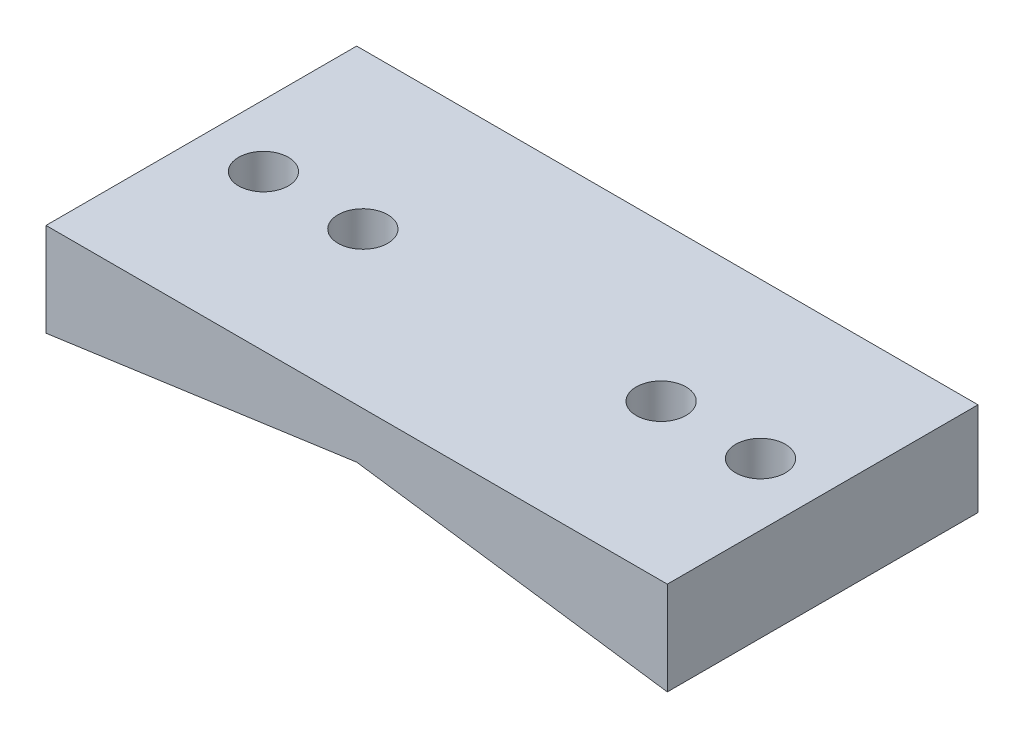
ISO-10303-21;
HEADER;
FILE_DESCRIPTION(('STEP AP214'),'2;1');
FILE_NAME('part.step','',(''),(''),'','','');
FILE_SCHEMA(('AUTOMOTIVE_DESIGN { 1 0 10303 214 1 1 1 1 }'));
ENDSEC;
DATA;
#1=APPLICATION_CONTEXT('core data for automotive mechanical design processes');
#2=APPLICATION_PROTOCOL_DEFINITION('international standard','automotive_design',2000,#1);
#3=PRODUCT_CONTEXT('',#1,'mechanical');
#4=PRODUCT('Part','Part','',(#3));
#5=PRODUCT_RELATED_PRODUCT_CATEGORY('part','',(#4));
#6=PRODUCT_DEFINITION_FORMATION('','',#4);
#7=PRODUCT_DEFINITION_CONTEXT('part definition',#1,'design');
#8=PRODUCT_DEFINITION('design','',#6,#7);
#9=PRODUCT_DEFINITION_SHAPE('','',#8);
#10=(LENGTH_UNIT() NAMED_UNIT(*) SI_UNIT(.MILLI.,.METRE.));
#11=(NAMED_UNIT(*) PLANE_ANGLE_UNIT() SI_UNIT($,.RADIAN.));
#12=(NAMED_UNIT(*) SI_UNIT($,.STERADIAN.) SOLID_ANGLE_UNIT());
#13=UNCERTAINTY_MEASURE_WITH_UNIT(LENGTH_MEASURE(1.E-05),#10,'distance_accuracy_value','');
#14=(GEOMETRIC_REPRESENTATION_CONTEXT(3) GLOBAL_UNCERTAINTY_ASSIGNED_CONTEXT((#13)) GLOBAL_UNIT_ASSIGNED_CONTEXT((#10,
#11,#12)) REPRESENTATION_CONTEXT('',''));
#15=CARTESIAN_POINT('',(0.,0.,0.));
#16=DIRECTION('',(0.,0.,1.));
#17=DIRECTION('',(1.,0.,0.));
#18=AXIS2_PLACEMENT_3D('',#15,#16,#17);
#19=CARTESIAN_POINT('',(-50.,-10.,25.));
#20=DIRECTION('',(-1.,0.,0.));
#21=DIRECTION('',(0.,0.,1.));
#22=AXIS2_PLACEMENT_3D('',#19,#20,#21);
#23=PLANE('',#22);
#24=DIRECTION('',(0.,0.,-1.));
#25=VECTOR('',#24,1.);
#26=CARTESIAN_POINT('',(-50.,-5.02704173511958,25.));
#27=LINE('',#26,#25);
#28=CARTESIAN_POINT('',(-50.,-5.02704173511958,25.));
#29=VERTEX_POINT('',#28);
#30=CARTESIAN_POINT('',(-50.,-5.02704173511959,-25.));
#31=VERTEX_POINT('',#30);
#32=EDGE_CURVE('E50',#29,#31,#27,.T.);
#33=ORIENTED_EDGE('',*,*,#32,.F.);
#34=DIRECTION('',(0.,1.,0.));
#35=VECTOR('',#34,1.);
#36=CARTESIAN_POINT('',(-50.,-10.,25.));
#37=LINE('',#36,#35);
#38=CARTESIAN_POINT('',(-50.,10.,25.));
#39=VERTEX_POINT('',#38);
#40=EDGE_CURVE('E82',#29,#39,#37,.T.);
#41=ORIENTED_EDGE('',*,*,#40,.T.);
#42=DIRECTION('',(0.,0.,-1.));
#43=VECTOR('',#42,1.);
#44=CARTESIAN_POINT('',(-50.,10.,25.));
#45=LINE('',#44,#43);
#46=CARTESIAN_POINT('',(-50.,10.,-25.));
#47=VERTEX_POINT('',#46);
#48=EDGE_CURVE('E42',#39,#47,#45,.T.);
#49=ORIENTED_EDGE('',*,*,#48,.T.);
#50=DIRECTION('',(0.,1.,0.));
#51=VECTOR('',#50,1.);
#52=CARTESIAN_POINT('',(-50.,-10.,-25.));
#53=LINE('',#52,#51);
#54=EDGE_CURVE('E92',#31,#47,#53,.T.);
#55=ORIENTED_EDGE('',*,*,#54,.F.);
#56=EDGE_LOOP('',(#33,#41,#49,#55));
#57=FACE_BOUND('',#56,.T.);
#58=ADVANCED_FACE('F34',(#57),#23,.T.);
#59=CARTESIAN_POINT('',(50.,-10.,25.));
#60=DIRECTION('',(-1.,0.,0.));
#61=DIRECTION('',(0.,0.,1.));
#62=AXIS2_PLACEMENT_3D('',#59,#60,#61);
#63=PLANE('',#62);
#64=DIRECTION('',(0.,1.,0.));
#65=VECTOR('',#64,1.);
#66=CARTESIAN_POINT('',(50.,-10.,25.));
#67=LINE('',#66,#65);
#68=CARTESIAN_POINT('',(50.,-5.0270417351196,25.));
#69=VERTEX_POINT('',#68);
#70=CARTESIAN_POINT('',(50.,10.,25.));
#71=VERTEX_POINT('',#70);
#72=EDGE_CURVE('E59',#69,#71,#67,.T.);
#73=ORIENTED_EDGE('',*,*,#72,.F.);
#74=DIRECTION('',(0.,0.,-1.));
#75=VECTOR('',#74,1.);
#76=CARTESIAN_POINT('',(50.,-5.0270417351196,25.));
#77=LINE('',#76,#75);
#78=CARTESIAN_POINT('',(50.,-5.0270417351196,-25.));
#79=VERTEX_POINT('',#78);
#80=EDGE_CURVE('E78',#69,#79,#77,.T.);
#81=ORIENTED_EDGE('',*,*,#80,.T.);
#82=DIRECTION('',(0.,1.,0.));
#83=VECTOR('',#82,1.);
#84=CARTESIAN_POINT('',(50.,-10.,-25.));
#85=LINE('',#84,#83);
#86=CARTESIAN_POINT('',(50.,10.,-25.));
#87=VERTEX_POINT('',#86);
#88=EDGE_CURVE('E73',#79,#87,#85,.T.);
#89=ORIENTED_EDGE('',*,*,#88,.T.);
#90=DIRECTION('',(0.,0.,-1.));
#91=VECTOR('',#90,1.);
#92=CARTESIAN_POINT('',(50.,10.,25.));
#93=LINE('',#92,#91);
#94=EDGE_CURVE('E11',#71,#87,#93,.T.);
#95=ORIENTED_EDGE('',*,*,#94,.F.);
#96=EDGE_LOOP('',(#73,#81,#89,#95));
#97=FACE_BOUND('',#96,.T.);
#98=ADVANCED_FACE('F74',(#97),#63,.F.);
#99=CARTESIAN_POINT('',(-50.,10.,25.));
#100=DIRECTION('',(0.,1.,0.));
#101=DIRECTION('',(0.,0.,1.));
#102=AXIS2_PLACEMENT_3D('',#99,#100,#101);
#103=PLANE('',#102);
#104=CARTESIAN_POINT('',(40.,10.,0.));
#105=DIRECTION('',(0.,-1.,0.));
#106=DIRECTION('',(0.,0.,-1.));
#107=AXIS2_PLACEMENT_3D('',#104,#105,#106);
#108=CIRCLE('',#107,4.);
#109=CARTESIAN_POINT('',(40.,10.,-4.));
#110=VERTEX_POINT('',#109);
#111=EDGE_CURVE('E119',#110,#110,#108,.T.);
#112=ORIENTED_EDGE('',*,*,#111,.T.);
#113=EDGE_LOOP('',(#112));
#114=FACE_BOUND('',#113,.T.);
#115=CARTESIAN_POINT('',(-40.,10.,0.));
#116=DIRECTION('',(0.,-1.,0.));
#117=DIRECTION('',(0.,0.,-1.));
#118=AXIS2_PLACEMENT_3D('',#115,#116,#117);
#119=CIRCLE('',#118,4.);
#120=CARTESIAN_POINT('',(-40.,10.,-4.));
#121=VERTEX_POINT('',#120);
#122=EDGE_CURVE('E122',#121,#121,#119,.T.);
#123=ORIENTED_EDGE('',*,*,#122,.T.);
#124=EDGE_LOOP('',(#123));
#125=FACE_BOUND('',#124,.T.);
#126=CARTESIAN_POINT('',(-24.,10.,0.));
#127=DIRECTION('',(0.,-1.,0.));
#128=DIRECTION('',(0.,0.,-1.));
#129=AXIS2_PLACEMENT_3D('',#126,#127,#128);
#130=CIRCLE('',#129,4.);
#131=CARTESIAN_POINT('',(-24.,10.,-4.));
#132=VERTEX_POINT('',#131);
#133=EDGE_CURVE('E131',#132,#132,#130,.T.);
#134=ORIENTED_EDGE('',*,*,#133,.T.);
#135=EDGE_LOOP('',(#134));
#136=FACE_BOUND('',#135,.T.);
#137=CARTESIAN_POINT('',(24.,10.,0.));
#138=DIRECTION('',(0.,-1.,0.));
#139=DIRECTION('',(0.,0.,-1.));
#140=AXIS2_PLACEMENT_3D('',#137,#138,#139);
#141=CIRCLE('',#140,4.);
#142=CARTESIAN_POINT('',(24.,10.,-4.));
#143=VERTEX_POINT('',#142);
#144=EDGE_CURVE('E95',#143,#143,#141,.T.);
#145=ORIENTED_EDGE('',*,*,#144,.T.);
#146=EDGE_LOOP('',(#145));
#147=FACE_BOUND('',#146,.T.);
#148=DIRECTION('',(1.,0.,0.));
#149=VECTOR('',#148,1.);
#150=CARTESIAN_POINT('',(-50.,10.,-25.));
#151=LINE('',#150,#149);
#152=EDGE_CURVE('E83',#47,#87,#151,.T.);
#153=ORIENTED_EDGE('',*,*,#152,.F.);
#154=ORIENTED_EDGE('',*,*,#48,.F.);
#155=DIRECTION('',(1.,0.,0.));
#156=VECTOR('',#155,1.);
#157=CARTESIAN_POINT('',(-50.,10.,25.));
#158=LINE('',#157,#156);
#159=EDGE_CURVE('E89',#39,#71,#158,.T.);
#160=ORIENTED_EDGE('',*,*,#159,.T.);
#161=ORIENTED_EDGE('',*,*,#94,.T.);
#162=EDGE_LOOP('',(#153,#154,#160,#161));
#163=FACE_BOUND('',#162,.T.);
#164=ADVANCED_FACE('F87',(#114,#125,#136,#147,#163),#103,.T.);
#165=CARTESIAN_POINT('',(0.,0.,25.));
#166=DIRECTION('',(0.,0.,-1.));
#167=DIRECTION('',(-1.,0.,0.));
#168=AXIS2_PLACEMENT_3D('',#165,#166,#167);
#169=PLANE('',#168);
#170=DIRECTION('',(0.99026806874157,0.139173100960066,0.));
#171=VECTOR('',#170,1.);
#172=CARTESIAN_POINT('',(-50.,-5.02704173511958,25.));
#173=LINE('',#172,#171);
#174=CARTESIAN_POINT('',(0.,2.,25.));
#175=VERTEX_POINT('',#174);
#176=EDGE_CURVE('E149',#29,#175,#173,.T.);
#177=ORIENTED_EDGE('',*,*,#176,.T.);
#178=DIRECTION('',(0.99026806874157,-0.139173100960066,0.));
#179=VECTOR('',#178,1.);
#180=CARTESIAN_POINT('',(0.,2.,25.));
#181=LINE('',#180,#179);
#182=EDGE_CURVE('E114',#175,#69,#181,.T.);
#183=ORIENTED_EDGE('',*,*,#182,.T.);
#184=ORIENTED_EDGE('',*,*,#72,.T.);
#185=ORIENTED_EDGE('',*,*,#159,.F.);
#186=ORIENTED_EDGE('',*,*,#40,.F.);
#187=EDGE_LOOP('',(#177,#183,#184,#185,#186));
#188=FACE_BOUND('',#187,.T.);
#189=ADVANCED_FACE('F147',(#188),#169,.F.);
#190=CARTESIAN_POINT('',(0.,0.,-25.));
#191=DIRECTION('',(0.,0.,-1.));
#192=DIRECTION('',(-1.,0.,0.));
#193=AXIS2_PLACEMENT_3D('',#190,#191,#192);
#194=PLANE('',#193);
#195=DIRECTION('',(0.99026806874157,-0.139173100960066,0.));
#196=VECTOR('',#195,1.);
#197=CARTESIAN_POINT('',(0.,2.,-25.));
#198=LINE('',#197,#196);
#199=CARTESIAN_POINT('',(0.,2.,-25.));
#200=VERTEX_POINT('',#199);
#201=EDGE_CURVE('E111',#200,#79,#198,.T.);
#202=ORIENTED_EDGE('',*,*,#201,.F.);
#203=DIRECTION('',(0.99026806874157,0.139173100960066,0.));
#204=VECTOR('',#203,1.);
#205=CARTESIAN_POINT('',(-50.,-5.02704173511958,-25.));
#206=LINE('',#205,#204);
#207=EDGE_CURVE('E296',#31,#200,#206,.T.);
#208=ORIENTED_EDGE('',*,*,#207,.F.);
#209=ORIENTED_EDGE('',*,*,#54,.T.);
#210=ORIENTED_EDGE('',*,*,#152,.T.);
#211=ORIENTED_EDGE('',*,*,#88,.F.);
#212=EDGE_LOOP('',(#202,#208,#209,#210,#211));
#213=FACE_BOUND('',#212,.T.);
#214=ADVANCED_FACE('F90',(#213),#194,.T.);
#215=CARTESIAN_POINT('',(24.,-10.,0.));
#216=DIRECTION('',(0.,-1.,0.));
#217=DIRECTION('',(0.,0.,-1.));
#218=AXIS2_PLACEMENT_3D('',#215,#216,#217);
#219=CYLINDRICAL_SURFACE('',#218,4.);
#220=ORIENTED_EDGE('',*,*,#144,.F.);
#221=EDGE_LOOP('',(#220));
#222=FACE_BOUND('',#221,.T.);
#223=CARTESIAN_POINT('',(24.,4.,0.));
#224=DIRECTION('',(0.,-1.,0.));
#225=DIRECTION('',(0.,0.,-1.));
#226=AXIS2_PLACEMENT_3D('',#223,#224,#225);
#227=CIRCLE('',#226,4.);
#228=CARTESIAN_POINT('',(24.,4.,-4.));
#229=VERTEX_POINT('',#228);
#230=EDGE_CURVE('E137',#229,#229,#227,.T.);
#231=ORIENTED_EDGE('',*,*,#230,.T.);
#232=EDGE_LOOP('',(#231));
#233=FACE_BOUND('',#232,.T.);
#234=ADVANCED_FACE('F156',(#222,#233),#219,.F.);
#235=CARTESIAN_POINT('',(24.,0.,0.));
#236=DIRECTION('',(0.,-1.,0.));
#237=DIRECTION('',(0.,0.,-1.));
#238=AXIS2_PLACEMENT_3D('',#235,#236,#237);
#239=CONICAL_SURFACE('',#238,8.,0.785398163397449);
#240=ORIENTED_EDGE('',*,*,#230,.F.);
#241=EDGE_LOOP('',(#240));
#242=FACE_BOUND('',#241,.T.);
#243=CARTESIAN_POINT('',(24.,0.,0.));
#244=DIRECTION('',(0.,-1.,0.));
#245=DIRECTION('',(0.,0.,-1.));
#246=AXIS2_PLACEMENT_3D('',#243,#244,#245);
#247=CIRCLE('',#246,8.);
#248=CARTESIAN_POINT('',(24.,0.,-8.));
#249=VERTEX_POINT('',#248);
#250=EDGE_CURVE('E134',#249,#249,#247,.T.);
#251=ORIENTED_EDGE('',*,*,#250,.T.);
#252=EDGE_LOOP('',(#251));
#253=FACE_BOUND('',#252,.T.);
#254=ADVANCED_FACE('F196',(#242,#253),#239,.F.);
#255=CARTESIAN_POINT('',(24.,-10.,0.));
#256=DIRECTION('',(0.,-1.,0.));
#257=DIRECTION('',(0.,0.,-1.));
#258=AXIS2_PLACEMENT_3D('',#255,#256,#257);
#259=CYLINDRICAL_SURFACE('',#258,8.);
#260=CARTESIAN_POINT('',(24.,-1.37298003285741,0.));
#261=DIRECTION('',(0.139173100960066,0.99026806874157,0.));
#262=DIRECTION('',(0.99026806874157,-0.139173100960066,0.));
#263=AXIS2_PLACEMENT_3D('',#260,#261,#262);
#264=ELLIPSE('',#263,8.07862058014895,8.);
#265=CARTESIAN_POINT('',(32.,-2.49730671047654,0.));
#266=VERTEX_POINT('',#265);
#267=EDGE_CURVE('E101',#266,#266,#264,.F.);
#268=ORIENTED_EDGE('',*,*,#267,.T.);
#269=EDGE_LOOP('',(#268));
#270=FACE_BOUND('',#269,.T.);
#271=ORIENTED_EDGE('',*,*,#250,.F.);
#272=EDGE_LOOP('',(#271));
#273=FACE_BOUND('',#272,.T.);
#274=ADVANCED_FACE('F202',(#270,#273),#259,.F.);
#275=CARTESIAN_POINT('',(-24.,-10.,0.));
#276=DIRECTION('',(0.,-1.,0.));
#277=DIRECTION('',(0.,0.,-1.));
#278=AXIS2_PLACEMENT_3D('',#275,#276,#277);
#279=CYLINDRICAL_SURFACE('',#278,4.);
#280=ORIENTED_EDGE('',*,*,#133,.F.);
#281=EDGE_LOOP('',(#280));
#282=FACE_BOUND('',#281,.T.);
#283=CARTESIAN_POINT('',(-24.,4.,0.));
#284=DIRECTION('',(0.,-1.,0.));
#285=DIRECTION('',(0.,0.,-1.));
#286=AXIS2_PLACEMENT_3D('',#283,#284,#285);
#287=CIRCLE('',#286,4.);
#288=CARTESIAN_POINT('',(-24.,4.,-4.));
#289=VERTEX_POINT('',#288);
#290=EDGE_CURVE('E128',#289,#289,#287,.T.);
#291=ORIENTED_EDGE('',*,*,#290,.T.);
#292=EDGE_LOOP('',(#291));
#293=FACE_BOUND('',#292,.T.);
#294=ADVANCED_FACE('F210',(#282,#293),#279,.F.);
#295=CARTESIAN_POINT('',(-24.,0.,0.));
#296=DIRECTION('',(0.,-1.,0.));
#297=DIRECTION('',(0.,0.,-1.));
#298=AXIS2_PLACEMENT_3D('',#295,#296,#297);
#299=CONICAL_SURFACE('',#298,8.,0.785398163397449);
#300=ORIENTED_EDGE('',*,*,#290,.F.);
#301=EDGE_LOOP('',(#300));
#302=FACE_BOUND('',#301,.T.);
#303=CARTESIAN_POINT('',(-24.,0.,0.));
#304=DIRECTION('',(0.,-1.,0.));
#305=DIRECTION('',(0.,0.,-1.));
#306=AXIS2_PLACEMENT_3D('',#303,#304,#305);
#307=CIRCLE('',#306,8.);
#308=CARTESIAN_POINT('',(-24.,0.,-8.));
#309=VERTEX_POINT('',#308);
#310=EDGE_CURVE('E125',#309,#309,#307,.T.);
#311=ORIENTED_EDGE('',*,*,#310,.T.);
#312=EDGE_LOOP('',(#311));
#313=FACE_BOUND('',#312,.T.);
#314=ADVANCED_FACE('F218',(#302,#313),#299,.F.);
#315=CARTESIAN_POINT('',(-24.,-10.,0.));
#316=DIRECTION('',(0.,-1.,0.));
#317=DIRECTION('',(0.,0.,-1.));
#318=AXIS2_PLACEMENT_3D('',#315,#316,#317);
#319=CYLINDRICAL_SURFACE('',#318,8.);
#320=CARTESIAN_POINT('',(-24.,-1.3729800328574,0.));
#321=DIRECTION('',(-0.139173100960066,0.99026806874157,0.));
#322=DIRECTION('',(-0.99026806874157,-0.139173100960066,0.));
#323=AXIS2_PLACEMENT_3D('',#320,#321,#322);
#324=ELLIPSE('',#323,8.07862058014894,8.);
#325=CARTESIAN_POINT('',(-32.,-2.49730671047654,0.));
#326=VERTEX_POINT('',#325);
#327=EDGE_CURVE('E116',#326,#326,#324,.F.);
#328=ORIENTED_EDGE('',*,*,#327,.T.);
#329=EDGE_LOOP('',(#328));
#330=FACE_BOUND('',#329,.T.);
#331=ORIENTED_EDGE('',*,*,#310,.F.);
#332=EDGE_LOOP('',(#331));
#333=FACE_BOUND('',#332,.T.);
#334=ADVANCED_FACE('F225',(#330,#333),#319,.F.);
#335=CARTESIAN_POINT('',(-40.,-10.,0.));
#336=DIRECTION('',(0.,-1.,0.));
#337=DIRECTION('',(0.,0.,-1.));
#338=AXIS2_PLACEMENT_3D('',#335,#336,#337);
#339=CYLINDRICAL_SURFACE('',#338,4.);
#340=CARTESIAN_POINT('',(-40.,-3.62163338809567,0.));
#341=DIRECTION('',(-0.139173100960066,0.99026806874157,0.));
#342=DIRECTION('',(-0.99026806874157,-0.139173100960066,0.));
#343=AXIS2_PLACEMENT_3D('',#340,#341,#342);
#344=ELLIPSE('',#343,4.03931029007447,4.);
#345=CARTESIAN_POINT('',(-44.,-4.18379672690523,0.));
#346=VERTEX_POINT('',#345);
#347=EDGE_CURVE('E37',#346,#346,#344,.F.);
#348=ORIENTED_EDGE('',*,*,#347,.T.);
#349=EDGE_LOOP('',(#348));
#350=FACE_BOUND('',#349,.T.);
#351=ORIENTED_EDGE('',*,*,#122,.F.);
#352=EDGE_LOOP('',(#351));
#353=FACE_BOUND('',#352,.T.);
#354=ADVANCED_FACE('F232',(#350,#353),#339,.F.);
#355=CARTESIAN_POINT('',(40.,-10.,0.));
#356=DIRECTION('',(0.,-1.,0.));
#357=DIRECTION('',(0.,0.,-1.));
#358=AXIS2_PLACEMENT_3D('',#355,#356,#357);
#359=CYLINDRICAL_SURFACE('',#358,4.);
#360=CARTESIAN_POINT('',(40.,-3.62163338809568,0.));
#361=DIRECTION('',(0.139173100960066,0.99026806874157,0.));
#362=DIRECTION('',(0.99026806874157,-0.139173100960066,0.));
#363=AXIS2_PLACEMENT_3D('',#360,#361,#362);
#364=ELLIPSE('',#363,4.03931029007447,4.);
#365=CARTESIAN_POINT('',(44.,-4.18379672690524,0.));
#366=VERTEX_POINT('',#365);
#367=EDGE_CURVE('E99',#366,#366,#364,.F.);
#368=ORIENTED_EDGE('',*,*,#367,.T.);
#369=EDGE_LOOP('',(#368));
#370=FACE_BOUND('',#369,.T.);
#371=ORIENTED_EDGE('',*,*,#111,.F.);
#372=EDGE_LOOP('',(#371));
#373=FACE_BOUND('',#372,.T.);
#374=ADVANCED_FACE('F240',(#370,#373),#359,.F.);
#375=CARTESIAN_POINT('',(-50.,-5.02704173511958,25.));
#376=DIRECTION('',(-0.139173100960066,0.99026806874157,0.));
#377=DIRECTION('',(-0.99026806874157,-0.139173100960066,0.));
#378=AXIS2_PLACEMENT_3D('',#375,#376,#377);
#379=PLANE('',#378);
#380=ORIENTED_EDGE('',*,*,#347,.F.);
#381=EDGE_LOOP('',(#380));
#382=FACE_BOUND('',#381,.T.);
#383=ORIENTED_EDGE('',*,*,#207,.T.);
#384=DIRECTION('',(0.,0.,-1.));
#385=VECTOR('',#384,1.);
#386=CARTESIAN_POINT('',(0.,2.,25.));
#387=LINE('',#386,#385);
#388=EDGE_CURVE('E106',#175,#200,#387,.T.);
#389=ORIENTED_EDGE('',*,*,#388,.F.);
#390=ORIENTED_EDGE('',*,*,#176,.F.);
#391=ORIENTED_EDGE('',*,*,#32,.T.);
#392=EDGE_LOOP('',(#383,#389,#390,#391));
#393=FACE_BOUND('',#392,.T.);
#394=ORIENTED_EDGE('',*,*,#327,.F.);
#395=EDGE_LOOP('',(#394));
#396=FACE_BOUND('',#395,.T.);
#397=ADVANCED_FACE('F248',(#382,#393,#396),#379,.F.);
#398=CARTESIAN_POINT('',(0.,2.,25.));
#399=DIRECTION('',(0.139173100960066,0.99026806874157,0.));
#400=DIRECTION('',(-0.99026806874157,0.139173100960066,0.));
#401=AXIS2_PLACEMENT_3D('',#398,#399,#400);
#402=PLANE('',#401);
#403=ORIENTED_EDGE('',*,*,#367,.F.);
#404=EDGE_LOOP('',(#403));
#405=FACE_BOUND('',#404,.T.);
#406=ORIENTED_EDGE('',*,*,#201,.T.);
#407=ORIENTED_EDGE('',*,*,#80,.F.);
#408=ORIENTED_EDGE('',*,*,#182,.F.);
#409=ORIENTED_EDGE('',*,*,#388,.T.);
#410=EDGE_LOOP('',(#406,#407,#408,#409));
#411=FACE_BOUND('',#410,.T.);
#412=ORIENTED_EDGE('',*,*,#267,.F.);
#413=EDGE_LOOP('',(#412));
#414=FACE_BOUND('',#413,.T.);
#415=ADVANCED_FACE('F255',(#405,#411,#414),#402,.F.);
#416=CLOSED_SHELL('',(#58,#98,#164,#189,#214,#234,#254,#274,#294,#314,#334,#354,#374,#397,#415));
#417=MANIFOLD_SOLID_BREP('B2',#416);
#418=ADVANCED_BREP_SHAPE_REPRESENTATION('',(#18,#417),#14);
#419=SHAPE_DEFINITION_REPRESENTATION(#9,#418);
ENDSEC;
END-ISO-10303-21;
